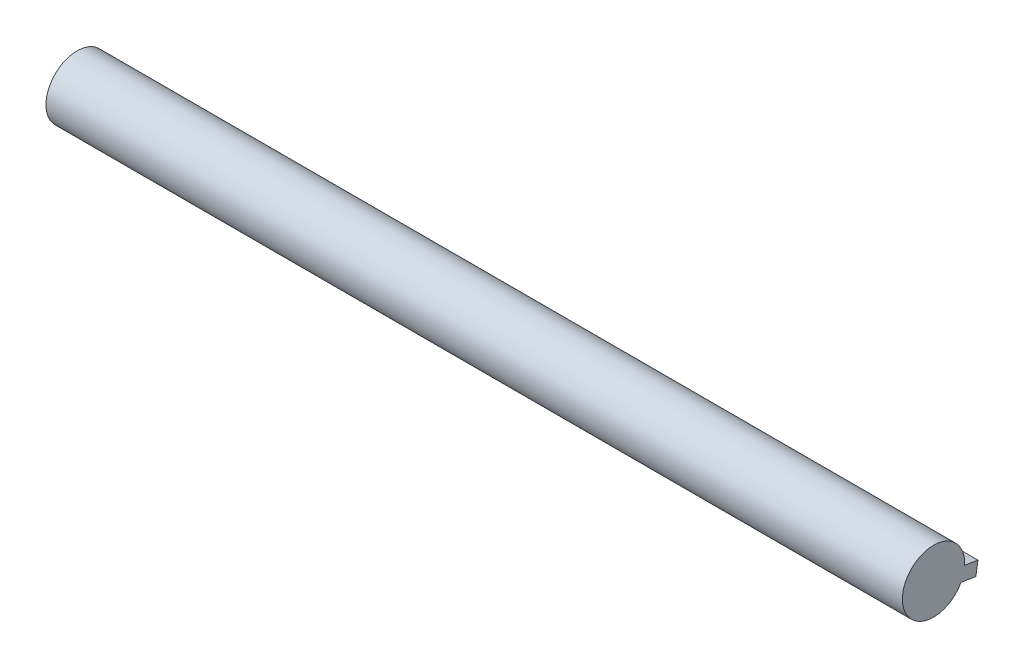
ISO-10303-21;
HEADER;
FILE_DESCRIPTION(('STEP AP214'),'2;1');
FILE_NAME('part.step','',(''),(''),'','','');
FILE_SCHEMA(('AUTOMOTIVE_DESIGN { 1 0 10303 214 1 1 1 1 }'));
ENDSEC;
DATA;
#1=APPLICATION_CONTEXT('core data for automotive mechanical design processes');
#2=APPLICATION_PROTOCOL_DEFINITION('international standard','automotive_design',2000,#1);
#3=PRODUCT_CONTEXT('',#1,'mechanical');
#4=PRODUCT('Part','Part','',(#3));
#5=PRODUCT_RELATED_PRODUCT_CATEGORY('part','',(#4));
#6=PRODUCT_DEFINITION_FORMATION('','',#4);
#7=PRODUCT_DEFINITION_CONTEXT('part definition',#1,'design');
#8=PRODUCT_DEFINITION('design','',#6,#7);
#9=PRODUCT_DEFINITION_SHAPE('','',#8);
#10=(LENGTH_UNIT() NAMED_UNIT(*) SI_UNIT(.MILLI.,.METRE.));
#11=(NAMED_UNIT(*) PLANE_ANGLE_UNIT() SI_UNIT($,.RADIAN.));
#12=(NAMED_UNIT(*) SI_UNIT($,.STERADIAN.) SOLID_ANGLE_UNIT());
#13=UNCERTAINTY_MEASURE_WITH_UNIT(LENGTH_MEASURE(1.E-05),#10,'distance_accuracy_value','');
#14=(GEOMETRIC_REPRESENTATION_CONTEXT(3) GLOBAL_UNCERTAINTY_ASSIGNED_CONTEXT((#13)) GLOBAL_UNIT_ASSIGNED_CONTEXT((#10,
#11,#12)) REPRESENTATION_CONTEXT('',''));
#15=CARTESIAN_POINT('',(0.,0.,0.));
#16=DIRECTION('',(0.,0.,1.));
#17=DIRECTION('',(1.,0.,0.));
#18=AXIS2_PLACEMENT_3D('',#15,#16,#17);
#19=CARTESIAN_POINT('',(192.48,-3.8490758916263,-9.5030067132046));
#20=DIRECTION('',(0.,0.986864417744133,-0.161550676230502));
#21=DIRECTION('',(0.,0.161550676230502,0.986864417744134));
#22=AXIS2_PLACEMENT_3D('',#19,#20,#21);
#23=PLANE('',#22);
#24=DIRECTION('',(-1.,0.,0.));
#25=VECTOR('',#24,1.);
#26=CARTESIAN_POINT('',(192.48,-3.3036820548028,-6.17136005113735));
#27=LINE('',#26,#25);
#28=CARTESIAN_POINT('',(177.48,-3.3036820548028,-6.17136005113735));
#29=VERTEX_POINT('',#28);
#30=CARTESIAN_POINT('',(192.48,-3.3036820548028,-6.17136005113735));
#31=VERTEX_POINT('',#30);
#32=EDGE_CURVE('E61',#29,#31,#27,.F.);
#33=ORIENTED_EDGE('',*,*,#32,.F.);
#34=DIRECTION('',(0.,0.161550676230502,0.986864417744133));
#35=VECTOR('',#34,1.);
#36=CARTESIAN_POINT('',(177.48,-3.8490758916263,-9.5030067132046));
#37=LINE('',#36,#35);
#38=CARTESIAN_POINT('',(177.48,-3.8490758916263,-9.5030067132046));
#39=VERTEX_POINT('',#38);
#40=EDGE_CURVE('E193',#39,#29,#37,.T.);
#41=ORIENTED_EDGE('',*,*,#40,.F.);
#42=DIRECTION('',(-1.,0.,0.));
#43=VECTOR('',#42,1.);
#44=CARTESIAN_POINT('',(192.48,-3.8490758916263,-9.5030067132046));
#45=LINE('',#44,#43);
#46=CARTESIAN_POINT('',(192.48,-3.8490758916263,-9.5030067132046));
#47=VERTEX_POINT('',#46);
#48=EDGE_CURVE('E176',#47,#39,#45,.T.);
#49=ORIENTED_EDGE('',*,*,#48,.F.);
#50=DIRECTION('',(0.,0.161550676230502,0.986864417744133));
#51=VECTOR('',#50,1.);
#52=CARTESIAN_POINT('',(192.48,-3.8490758916263,-9.5030067132046));
#53=LINE('',#52,#51);
#54=EDGE_CURVE('E51',#47,#31,#53,.T.);
#55=ORIENTED_EDGE('',*,*,#54,.T.);
#56=EDGE_LOOP('',(#33,#41,#49,#55));
#57=FACE_BOUND('',#56,.T.);
#58=ADVANCED_FACE('F42',(#57),#23,.F.);
#59=CARTESIAN_POINT('',(192.48,-0.888482638393897,-9.98765874189611));
#60=DIRECTION('',(0.,-0.986864417744133,0.161550676230502));
#61=DIRECTION('',(0.,-0.161550676230502,-0.986864417744134));
#62=AXIS2_PLACEMENT_3D('',#59,#60,#61);
#63=PLANE('',#62);
#64=DIRECTION('',(-1.,0.,0.));
#65=VECTOR('',#64,1.);
#66=CARTESIAN_POINT('',(192.48,-0.397550445418867,-6.98870185680769));
#67=LINE('',#66,#65);
#68=CARTESIAN_POINT('',(192.48,-0.397550445418868,-6.98870185680769));
#69=VERTEX_POINT('',#68);
#70=CARTESIAN_POINT('',(177.48,-0.397550445418866,-6.98870185680769));
#71=VERTEX_POINT('',#70);
#72=EDGE_CURVE('E11',#69,#71,#67,.T.);
#73=ORIENTED_EDGE('',*,*,#72,.F.);
#74=DIRECTION('',(0.,0.161550676230502,0.986864417744133));
#75=VECTOR('',#74,1.);
#76=CARTESIAN_POINT('',(192.48,-0.888482638393897,-9.98765874189611));
#77=LINE('',#76,#75);
#78=CARTESIAN_POINT('',(192.48,-0.888482638393897,-9.98765874189611));
#79=VERTEX_POINT('',#78);
#80=EDGE_CURVE('E185',#79,#69,#77,.T.);
#81=ORIENTED_EDGE('',*,*,#80,.F.);
#82=DIRECTION('',(1.,0.,0.));
#83=VECTOR('',#82,1.);
#84=CARTESIAN_POINT('',(192.48,-0.888482638393897,-9.98765874189611));
#85=LINE('',#84,#83);
#86=CARTESIAN_POINT('',(177.48,-0.888482638393895,-9.98765874189611));
#87=VERTEX_POINT('',#86);
#88=EDGE_CURVE('E182',#87,#79,#85,.T.);
#89=ORIENTED_EDGE('',*,*,#88,.F.);
#90=DIRECTION('',(0.,0.161550676230502,0.986864417744133));
#91=VECTOR('',#90,1.);
#92=CARTESIAN_POINT('',(177.48,-0.888482638393895,-9.98765874189611));
#93=LINE('',#92,#91);
#94=EDGE_CURVE('E189',#87,#71,#93,.T.);
#95=ORIENTED_EDGE('',*,*,#94,.T.);
#96=EDGE_LOOP('',(#73,#81,#89,#95));
#97=FACE_BOUND('',#96,.T.);
#98=ADVANCED_FACE('F228',(#97),#63,.F.);
#99=CARTESIAN_POINT('',(192.48,-3.8490758916263,-9.5030067132046));
#100=DIRECTION('',(-1.,0.,0.));
#101=DIRECTION('',(0.,0.,1.));
#102=AXIS2_PLACEMENT_3D('',#99,#100,#101);
#103=PLANE('',#102);
#104=ORIENTED_EDGE('',*,*,#80,.T.);
#105=CARTESIAN_POINT('',(192.48,0.,0.));
#106=DIRECTION('',(1.,0.,0.));
#107=DIRECTION('',(0.,0.,-1.));
#108=AXIS2_PLACEMENT_3D('',#105,#106,#107);
#109=CIRCLE('',#108,7.);
#110=EDGE_CURVE('E156',#69,#31,#109,.T.);
#111=ORIENTED_EDGE('',*,*,#110,.T.);
#112=ORIENTED_EDGE('',*,*,#54,.F.);
#113=DIRECTION('',(0.,-0.986864417744133,0.161550676230502));
#114=VECTOR('',#113,1.);
#115=CARTESIAN_POINT('',(192.48,-3.8490758916263,-9.5030067132046));
#116=LINE('',#115,#114);
#117=EDGE_CURVE('E172',#79,#47,#116,.T.);
#118=ORIENTED_EDGE('',*,*,#117,.F.);
#119=EDGE_LOOP('',(#104,#111,#112,#118));
#120=FACE_BOUND('',#119,.T.);
#121=ADVANCED_FACE('F44',(#120),#103,.F.);
#122=CARTESIAN_POINT('',(177.48,-3.8490758916263,-9.5030067132046));
#123=DIRECTION('',(1.,0.,0.));
#124=DIRECTION('',(0.,0.,-1.));
#125=AXIS2_PLACEMENT_3D('',#122,#123,#124);
#126=PLANE('',#125);
#127=CARTESIAN_POINT('',(177.48,0.,0.));
#128=DIRECTION('',(1.,0.,0.));
#129=DIRECTION('',(0.,0.,-1.));
#130=AXIS2_PLACEMENT_3D('',#127,#128,#129);
#131=CIRCLE('',#130,7.);
#132=EDGE_CURVE('E166',#71,#29,#131,.F.);
#133=ORIENTED_EDGE('',*,*,#132,.F.);
#134=ORIENTED_EDGE('',*,*,#94,.F.);
#135=DIRECTION('',(0.,0.986864417744133,-0.161550676230502));
#136=VECTOR('',#135,1.);
#137=CARTESIAN_POINT('',(177.48,-3.8490758916263,-9.5030067132046));
#138=LINE('',#137,#136);
#139=EDGE_CURVE('E179',#39,#87,#138,.T.);
#140=ORIENTED_EDGE('',*,*,#139,.F.);
#141=ORIENTED_EDGE('',*,*,#40,.T.);
#142=EDGE_LOOP('',(#133,#134,#140,#141));
#143=FACE_BOUND('',#142,.T.);
#144=ADVANCED_FACE('F221',(#143),#126,.F.);
#145=CARTESIAN_POINT('',(0.,-1.61550676230502,-9.86864417744134));
#146=DIRECTION('',(0.,0.161550676230502,0.986864417744134));
#147=DIRECTION('',(0.,-0.986864417744134,0.161550676230502));
#148=AXIS2_PLACEMENT_3D('',#145,#146,#147);
#149=PLANE('',#148);
#150=ORIENTED_EDGE('',*,*,#117,.T.);
#151=ORIENTED_EDGE('',*,*,#48,.T.);
#152=ORIENTED_EDGE('',*,*,#139,.T.);
#153=ORIENTED_EDGE('',*,*,#88,.T.);
#154=EDGE_LOOP('',(#150,#151,#152,#153));
#155=FACE_BOUND('',#154,.T.);
#156=ADVANCED_FACE('F233',(#155),#149,.F.);
#157=CARTESIAN_POINT('',(192.48,0.,0.));
#158=DIRECTION('',(-1.,0.,0.));
#159=DIRECTION('',(0.,0.,1.));
#160=AXIS2_PLACEMENT_3D('',#157,#158,#159);
#161=CYLINDRICAL_SURFACE('',#160,7.);
#162=CARTESIAN_POINT('',(16.7302334440534,0.,0.));
#163=DIRECTION('',(-1.,0.,0.));
#164=DIRECTION('',(0.,0.,1.));
#165=AXIS2_PLACEMENT_3D('',#162,#163,#164);
#166=CIRCLE('',#165,7.);
#167=CARTESIAN_POINT('',(16.7302334440534,-0.397550445418861,-6.98870185680769));
#168=VERTEX_POINT('',#167);
#169=CARTESIAN_POINT('',(16.7302334440534,-2.8957387838217,-6.37296609875424));
#170=VERTEX_POINT('',#169);
#171=EDGE_CURVE('E160',#168,#170,#166,.T.);
#172=ORIENTED_EDGE('',*,*,#171,.F.);
#173=DIRECTION('',(-1.,0.,0.));
#174=VECTOR('',#173,1.);
#175=CARTESIAN_POINT('',(192.48,-0.397550445418861,-6.98870185680769));
#176=LINE('',#175,#174);
#177=CARTESIAN_POINT('',(0.,-0.397550445418861,-6.98870185680769));
#178=VERTEX_POINT('',#177);
#179=EDGE_CURVE('E149',#178,#168,#176,.F.);
#180=ORIENTED_EDGE('',*,*,#179,.F.);
#181=CARTESIAN_POINT('',(0.,0.,0.));
#182=DIRECTION('',(1.,0.,0.));
#183=DIRECTION('',(0.,0.,-1.));
#184=AXIS2_PLACEMENT_3D('',#181,#182,#183);
#185=CIRCLE('',#184,7.);
#186=CARTESIAN_POINT('',(0.,-2.8957387838217,-6.37296609875424));
#187=VERTEX_POINT('',#186);
#188=EDGE_CURVE('E113',#178,#187,#185,.T.);
#189=ORIENTED_EDGE('',*,*,#188,.T.);
#190=DIRECTION('',(-1.,0.,0.));
#191=VECTOR('',#190,1.);
#192=CARTESIAN_POINT('',(192.48,-2.8957387838217,-6.37296609875424));
#193=LINE('',#192,#191);
#194=EDGE_CURVE('E152',#170,#187,#193,.T.);
#195=ORIENTED_EDGE('',*,*,#194,.F.);
#196=EDGE_LOOP('',(#172,#180,#189,#195));
#197=FACE_BOUND('',#196,.T.);
#198=ORIENTED_EDGE('',*,*,#132,.T.);
#199=ORIENTED_EDGE('',*,*,#32,.T.);
#200=ORIENTED_EDGE('',*,*,#110,.F.);
#201=ORIENTED_EDGE('',*,*,#72,.T.);
#202=EDGE_LOOP('',(#198,#199,#200,#201));
#203=FACE_BOUND('',#202,.T.);
#204=ADVANCED_FACE('F224',(#197,#203),#161,.T.);
#205=CARTESIAN_POINT('',(0.,0.,0.));
#206=DIRECTION('',(1.,0.,0.));
#207=DIRECTION('',(0.,0.,-1.));
#208=AXIS2_PLACEMENT_3D('',#205,#206,#207);
#209=PLANE('',#208);
#210=ORIENTED_EDGE('',*,*,#188,.F.);
#211=DIRECTION('',(0.,-0.161550676230502,-0.986864417744133));
#212=VECTOR('',#211,1.);
#213=CARTESIAN_POINT('',(0.,1.21167615260263,2.84157868877763));
#214=LINE('',#213,#212);
#215=CARTESIAN_POINT('',(0.,-0.888482638393895,-9.98765874189611));
#216=VERTEX_POINT('',#215);
#217=EDGE_CURVE('E107',#178,#216,#214,.T.);
#218=ORIENTED_EDGE('',*,*,#217,.T.);
#219=DIRECTION('',(0.,0.986864417744133,-0.161550676230502));
#220=VECTOR('',#219,1.);
#221=CARTESIAN_POINT('',(0.,-3.41963760470766,-9.57330618332792));
#222=LINE('',#221,#220);
#223=CARTESIAN_POINT('',(0.,-3.41963760470766,-9.57330618332792));
#224=VERTEX_POINT('',#223);
#225=EDGE_CURVE('E112',#224,#216,#222,.T.);
#226=ORIENTED_EDGE('',*,*,#225,.F.);
#227=DIRECTION('',(0.,-0.161550676230502,-0.986864417744133));
#228=VECTOR('',#227,1.);
#229=CARTESIAN_POINT('',(0.,-1.31947881371114,3.25593124734581));
#230=LINE('',#229,#228);
#231=EDGE_CURVE('E146',#187,#224,#230,.T.);
#232=ORIENTED_EDGE('',*,*,#231,.F.);
#233=EDGE_LOOP('',(#210,#218,#226,#232));
#234=FACE_BOUND('',#233,.T.);
#235=ADVANCED_FACE('F109',(#234),#209,.F.);
#236=CARTESIAN_POINT('',(16.7302334440534,1.21167615260263,2.84157868877763));
#237=DIRECTION('',(-1.,0.,0.));
#238=DIRECTION('',(0.,0.,1.));
#239=AXIS2_PLACEMENT_3D('',#236,#237,#238);
#240=PLANE('',#239);
#241=DIRECTION('',(0.,-0.161550676230502,-0.986864417744133));
#242=VECTOR('',#241,1.);
#243=CARTESIAN_POINT('',(16.7302334440534,1.21167615260263,2.84157868877763));
#244=LINE('',#243,#242);
#245=CARTESIAN_POINT('',(16.7302334440534,-0.888482638393895,-9.98765874189611));
#246=VERTEX_POINT('',#245);
#247=EDGE_CURVE('E117',#168,#246,#244,.T.);
#248=ORIENTED_EDGE('',*,*,#247,.F.);
#249=ORIENTED_EDGE('',*,*,#171,.T.);
#250=DIRECTION('',(0.,-0.161550676230502,-0.986864417744133));
#251=VECTOR('',#250,1.);
#252=CARTESIAN_POINT('',(16.7302334440534,-1.31947881371114,3.25593124734581));
#253=LINE('',#252,#251);
#254=CARTESIAN_POINT('',(16.7302334440534,-3.41963760470766,-9.57330618332792));
#255=VERTEX_POINT('',#254);
#256=EDGE_CURVE('E143',#170,#255,#253,.T.);
#257=ORIENTED_EDGE('',*,*,#256,.T.);
#258=DIRECTION('',(0.,-0.986864417744133,0.161550676230502));
#259=VECTOR('',#258,1.);
#260=CARTESIAN_POINT('',(16.7302334440534,-3.41963760470766,-9.57330618332792));
#261=LINE('',#260,#259);
#262=EDGE_CURVE('E128',#246,#255,#261,.T.);
#263=ORIENTED_EDGE('',*,*,#262,.F.);
#264=EDGE_LOOP('',(#248,#249,#257,#263));
#265=FACE_BOUND('',#264,.T.);
#266=ADVANCED_FACE('F249',(#265),#240,.F.);
#267=CARTESIAN_POINT('',(0.,-1.31947881371114,3.25593124734581));
#268=DIRECTION('',(0.,0.986864417744133,-0.161550676230502));
#269=DIRECTION('',(0.,0.161550676230502,0.986864417744133));
#270=AXIS2_PLACEMENT_3D('',#267,#268,#269);
#271=PLANE('',#270);
#272=ORIENTED_EDGE('',*,*,#256,.F.);
#273=ORIENTED_EDGE('',*,*,#194,.T.);
#274=ORIENTED_EDGE('',*,*,#231,.T.);
#275=DIRECTION('',(-1.,0.,0.));
#276=VECTOR('',#275,1.);
#277=CARTESIAN_POINT('',(0.,-3.41963760470766,-9.57330618332792));
#278=LINE('',#277,#276);
#279=EDGE_CURVE('E118',#255,#224,#278,.T.);
#280=ORIENTED_EDGE('',*,*,#279,.F.);
#281=EDGE_LOOP('',(#272,#273,#274,#280));
#282=FACE_BOUND('',#281,.T.);
#283=ADVANCED_FACE('F250',(#282),#271,.F.);
#284=CARTESIAN_POINT('',(0.,1.21167615260263,2.84157868877763));
#285=DIRECTION('',(0.,-0.986864417744133,0.161550676230502));
#286=DIRECTION('',(0.,-0.161550676230502,-0.986864417744133));
#287=AXIS2_PLACEMENT_3D('',#284,#285,#286);
#288=PLANE('',#287);
#289=ORIENTED_EDGE('',*,*,#217,.F.);
#290=ORIENTED_EDGE('',*,*,#179,.T.);
#291=ORIENTED_EDGE('',*,*,#247,.T.);
#292=DIRECTION('',(1.,0.,0.));
#293=VECTOR('',#292,1.);
#294=CARTESIAN_POINT('',(0.,-0.888482638393895,-9.98765874189611));
#295=LINE('',#294,#293);
#296=EDGE_CURVE('E121',#216,#246,#295,.T.);
#297=ORIENTED_EDGE('',*,*,#296,.F.);
#298=EDGE_LOOP('',(#289,#290,#291,#297));
#299=FACE_BOUND('',#298,.T.);
#300=ADVANCED_FACE('F122',(#299),#288,.F.);
#301=CARTESIAN_POINT('',(0.,-1.61550676230502,-9.86864417744134));
#302=DIRECTION('',(0.,-0.161550676230502,-0.986864417744133));
#303=DIRECTION('',(0.,0.986864417744133,-0.161550676230502));
#304=AXIS2_PLACEMENT_3D('',#301,#302,#303);
#305=PLANE('',#304);
#306=ORIENTED_EDGE('',*,*,#225,.T.);
#307=ORIENTED_EDGE('',*,*,#296,.T.);
#308=ORIENTED_EDGE('',*,*,#262,.T.);
#309=ORIENTED_EDGE('',*,*,#279,.T.);
#310=EDGE_LOOP('',(#306,#307,#308,#309));
#311=FACE_BOUND('',#310,.T.);
#312=ADVANCED_FACE('F131',(#311),#305,.T.);
#313=CLOSED_SHELL('',(#58,#98,#121,#144,#156,#204,#235,#266,#283,#300,#312));
#314=MANIFOLD_SOLID_BREP('B2',#313);
#315=ADVANCED_BREP_SHAPE_REPRESENTATION('',(#18,#314),#14);
#316=SHAPE_DEFINITION_REPRESENTATION(#9,#315);
ENDSEC;
END-ISO-10303-21;
